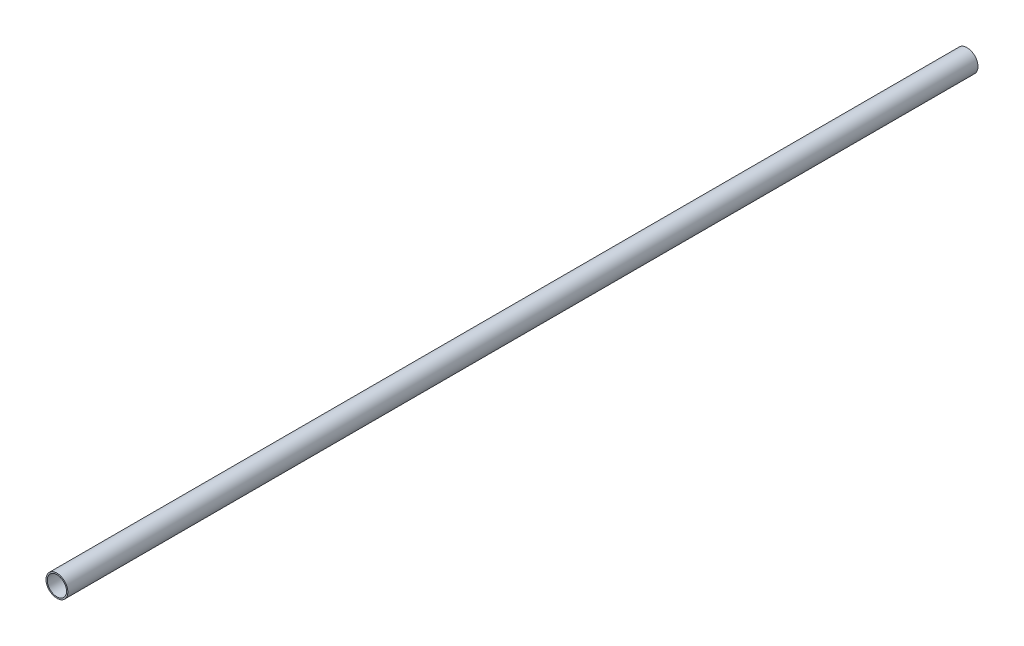
ISO-10303-21;
HEADER;
FILE_DESCRIPTION(('STEP AP214'),'2;1');
FILE_NAME('part.step','',(''),(''),'','','');
FILE_SCHEMA(('AUTOMOTIVE_DESIGN { 1 0 10303 214 1 1 1 1 }'));
ENDSEC;
DATA;
#1=APPLICATION_CONTEXT('core data for automotive mechanical design processes');
#2=APPLICATION_PROTOCOL_DEFINITION('international standard','automotive_design',2000,#1);
#3=PRODUCT_CONTEXT('',#1,'mechanical');
#4=PRODUCT('Part','Part','',(#3));
#5=PRODUCT_RELATED_PRODUCT_CATEGORY('part','',(#4));
#6=PRODUCT_DEFINITION_FORMATION('','',#4);
#7=PRODUCT_DEFINITION_CONTEXT('part definition',#1,'design');
#8=PRODUCT_DEFINITION('design','',#6,#7);
#9=PRODUCT_DEFINITION_SHAPE('','',#8);
#10=(LENGTH_UNIT() NAMED_UNIT(*) SI_UNIT(.MILLI.,.METRE.));
#11=(NAMED_UNIT(*) PLANE_ANGLE_UNIT() SI_UNIT($,.RADIAN.));
#12=(NAMED_UNIT(*) SI_UNIT($,.STERADIAN.) SOLID_ANGLE_UNIT());
#13=UNCERTAINTY_MEASURE_WITH_UNIT(LENGTH_MEASURE(1.E-05),#10,'distance_accuracy_value','');
#14=(GEOMETRIC_REPRESENTATION_CONTEXT(3) GLOBAL_UNCERTAINTY_ASSIGNED_CONTEXT((#13)) GLOBAL_UNIT_ASSIGNED_CONTEXT((#10,
#11,#12)) REPRESENTATION_CONTEXT('',''));
#15=CARTESIAN_POINT('',(0.,0.,0.));
#16=DIRECTION('',(0.,0.,1.));
#17=DIRECTION('',(1.,0.,0.));
#18=AXIS2_PLACEMENT_3D('',#15,#16,#17);
#19=CARTESIAN_POINT('',(-7.99360577730113E-12,654.,-3240.));
#20=DIRECTION('',(0.,0.,1.));
#21=DIRECTION('',(1.,0.,0.));
#22=AXIS2_PLACEMENT_3D('',#19,#20,#21);
#23=CYLINDRICAL_SURFACE('',#22,12.5);
#24=CARTESIAN_POINT('',(-1.24344978758018E-11,654.,-1060.));
#25=DIRECTION('',(0.,0.,-1.));
#26=DIRECTION('',(0.,1.,0.));
#27=AXIS2_PLACEMENT_3D('',#24,#25,#26);
#28=CIRCLE('',#27,12.5);
#29=CARTESIAN_POINT('',(12.499999999992,654.,-1060.));
#30=VERTEX_POINT('',#29);
#31=EDGE_CURVE('E59',#30,#30,#28,.T.);
#32=CARTESIAN_POINT('',(-2.22044604925031E-11,654.,-20.000000000002));
#33=DIRECTION('',(0.,0.,1.));
#34=DIRECTION('',(1.,0.,0.));
#35=AXIS2_PLACEMENT_3D('',#32,#33,#34);
#36=CIRCLE('',#35,12.5);
#37=CARTESIAN_POINT('',(12.499999999992,654.,-20.0000000000022));
#38=VERTEX_POINT('',#37);
#39=EDGE_CURVE('E45',#38,#38,#36,.T.);
#40=CARTESIAN_POINT('',(12.499999999992,654.,-1060.));
#41=CARTESIAN_POINT('',(12.499999999992,654.,-1049.16666666667));
#42=CARTESIAN_POINT('',(12.499999999992,654.,-1038.33333333333));
#43=CARTESIAN_POINT('',(12.499999999992,654.,-1016.66666666667));
#44=CARTESIAN_POINT('',(12.499999999992,654.,-1005.83333333333));
#45=CARTESIAN_POINT('',(12.499999999992,654.,-984.166666666665));
#46=CARTESIAN_POINT('',(12.499999999992,654.,-973.333333333332));
#47=CARTESIAN_POINT('',(12.499999999992,654.,-951.666666666666));
#48=CARTESIAN_POINT('',(12.499999999992,654.,-940.833333333333));
#49=CARTESIAN_POINT('',(12.499999999992,654.,-919.166666666666));
#50=CARTESIAN_POINT('',(12.499999999992,654.,-908.333333333332));
#51=CARTESIAN_POINT('',(12.499999999992,654.,-886.666666666666));
#52=CARTESIAN_POINT('',(12.499999999992,654.,-875.833333333333));
#53=CARTESIAN_POINT('',(12.499999999992,654.,-854.166666666666));
#54=CARTESIAN_POINT('',(12.499999999992,654.,-843.333333333333));
#55=CARTESIAN_POINT('',(12.499999999992,654.,-821.666666666666));
#56=CARTESIAN_POINT('',(12.499999999992,654.,-810.833333333333));
#57=CARTESIAN_POINT('',(12.499999999992,654.,-789.166666666667));
#58=CARTESIAN_POINT('',(12.499999999992,654.,-778.333333333333));
#59=CARTESIAN_POINT('',(12.499999999992,654.,-756.666666666666));
#60=CARTESIAN_POINT('',(12.499999999992,654.,-745.833333333333));
#61=CARTESIAN_POINT('',(12.499999999992,654.,-724.166666666667));
#62=CARTESIAN_POINT('',(12.499999999992,654.,-713.333333333333));
#63=CARTESIAN_POINT('',(12.499999999992,654.,-691.666666666666));
#64=CARTESIAN_POINT('',(12.499999999992,654.,-680.833333333333));
#65=CARTESIAN_POINT('',(12.499999999992,654.,-659.166666666667));
#66=CARTESIAN_POINT('',(12.499999999992,654.,-648.333333333333));
#67=CARTESIAN_POINT('',(12.499999999992,654.,-626.666666666667));
#68=CARTESIAN_POINT('',(12.499999999992,654.,-615.833333333334));
#69=CARTESIAN_POINT('',(12.499999999992,654.,-594.166666666667));
#70=CARTESIAN_POINT('',(12.499999999992,654.,-583.333333333334));
#71=CARTESIAN_POINT('',(12.499999999992,654.,-561.666666666667));
#72=CARTESIAN_POINT('',(12.499999999992,654.,-550.833333333334));
#73=CARTESIAN_POINT('',(12.499999999992,654.,-529.166666666667));
#74=CARTESIAN_POINT('',(12.499999999992,654.,-518.333333333334));
#75=CARTESIAN_POINT('',(12.499999999992,654.,-496.666666666667));
#76=CARTESIAN_POINT('',(12.499999999992,654.,-485.833333333334));
#77=CARTESIAN_POINT('',(12.499999999992,654.,-464.166666666667));
#78=CARTESIAN_POINT('',(12.499999999992,654.,-453.333333333334));
#79=CARTESIAN_POINT('',(12.499999999992,654.,-431.666666666668));
#80=CARTESIAN_POINT('',(12.499999999992,654.,-420.833333333334));
#81=CARTESIAN_POINT('',(12.499999999992,654.,-399.166666666668));
#82=CARTESIAN_POINT('',(12.499999999992,654.,-388.333333333335));
#83=CARTESIAN_POINT('',(12.499999999992,654.,-366.666666666668));
#84=CARTESIAN_POINT('',(12.499999999992,654.,-355.833333333335));
#85=CARTESIAN_POINT('',(12.499999999992,654.,-334.166666666668));
#86=CARTESIAN_POINT('',(12.499999999992,654.,-323.333333333335));
#87=CARTESIAN_POINT('',(12.499999999992,654.,-301.666666666668));
#88=CARTESIAN_POINT('',(12.499999999992,654.,-290.833333333335));
#89=CARTESIAN_POINT('',(12.499999999992,654.,-269.166666666668));
#90=CARTESIAN_POINT('',(12.499999999992,654.,-258.333333333335));
#91=CARTESIAN_POINT('',(12.499999999992,654.,-236.666666666668));
#92=CARTESIAN_POINT('',(12.499999999992,654.,-225.833333333335));
#93=CARTESIAN_POINT('',(12.499999999992,654.,-204.166666666668));
#94=CARTESIAN_POINT('',(12.499999999992,654.,-193.333333333335));
#95=CARTESIAN_POINT('',(12.499999999992,654.,-171.666666666669));
#96=CARTESIAN_POINT('',(12.499999999992,654.,-160.833333333335));
#97=CARTESIAN_POINT('',(12.499999999992,654.,-139.166666666668));
#98=CARTESIAN_POINT('',(12.499999999992,654.,-128.333333333335));
#99=CARTESIAN_POINT('',(12.499999999992,654.,-106.666666666669));
#100=CARTESIAN_POINT('',(12.499999999992,654.,-95.8333333333351));
#101=CARTESIAN_POINT('',(12.499999999992,654.,-74.1666666666685));
#102=CARTESIAN_POINT('',(12.499999999992,654.,-63.3333333333352));
#103=CARTESIAN_POINT('',(12.499999999992,654.,-41.6666666666687));
#104=CARTESIAN_POINT('',(12.499999999992,654.,-30.8333333333355));
#105=CARTESIAN_POINT('',(12.499999999992,654.,-20.0000000000022));
#106=B_SPLINE_CURVE_WITH_KNOTS('',3,(#40,#41,#42,#43,#44,#45,#46,#47,#48,#49,#50,#51,#52,#53,
#54,#55,#56,#57,#58,#59,#60,#61,#62,#63,#64,#65,#66,#67,#68,#69,#70,#71,#72,#73,#74,#75,#76,#77,
#78,#79,#80,#81,#82,#83,#84,#85,#86,#87,#88,#89,#90,#91,#92,#93,#94,#95,#96,#97,#98,#99,#100,
#101,#102,#103,#104,#105),.UNSPECIFIED.,.F.,.F.,(4,2,2,2,2,2,2,2,2,2,2,2,2,2,2,2,2,2,2,2,2,2,2,
2,2,2,2,2,2,2,2,2,4),(0.,32.4999999999998,64.9999999999999,97.4999999999997,129.999999999999,
162.5,194.999999999999,227.499999999999,259.999999999999,292.499999999999,324.999999999999,
357.499999999999,389.999999999999,422.499999999999,454.999999999998,487.499999999998,
519.999999999998,552.499999999998,584.999999999998,617.499999999998,649.999999999998,
682.499999999997,714.999999999998,747.499999999997,779.999999999998,812.499999999997,
844.999999999997,877.499999999997,909.999999999997,942.499999999997,974.999999999997,1007.5,
1040.),.UNSPECIFIED.);
#107=EDGE_CURVE('BSEAM41',#30,#38,#106,.T.);
#108=ORIENTED_EDGE('',*,*,#31,.F.);
#109=ORIENTED_EDGE('',*,*,#39,.F.);
#110=ORIENTED_EDGE('',*,*,#107,.T.);
#111=ORIENTED_EDGE('',*,*,#107,.F.);
#112=EDGE_LOOP('',(#108,#110,#109,#111));
#113=FACE_BOUND('',#112,.T.);
#114=ADVANCED_FACE('F41',(#113),#23,.T.);
#115=CARTESIAN_POINT('',(-15.5000000000096,-2.88657986402541E-12,-1059.99999999999));
#116=DIRECTION('',(0.,0.,-1.));
#117=DIRECTION('',(0.,1.,0.));
#118=AXIS2_PLACEMENT_3D('',#115,#116,#117);
#119=PLANE('',#118);
#120=CARTESIAN_POINT('',(-1.24344978758018E-11,654.,-1060.));
#121=DIRECTION('',(0.,0.,-1.));
#122=DIRECTION('',(0.,1.,0.));
#123=AXIS2_PLACEMENT_3D('',#120,#121,#122);
#124=CIRCLE('',#123,11.);
#125=CARTESIAN_POINT('',(10.999999999992,654.,-1060.));
#126=VERTEX_POINT('',#125);
#127=EDGE_CURVE('E57',#126,#126,#124,.T.);
#128=ORIENTED_EDGE('',*,*,#127,.F.);
#129=EDGE_LOOP('',(#128));
#130=FACE_BOUND('',#129,.T.);
#131=ORIENTED_EDGE('',*,*,#31,.T.);
#132=EDGE_LOOP('',(#131));
#133=FACE_BOUND('',#132,.T.);
#134=ADVANCED_FACE('F73',(#130,#133),#119,.T.);
#135=CARTESIAN_POINT('',(-15.5000000000145,4.21884749357559E-12,-20.));
#136=DIRECTION('',(0.,0.,1.));
#137=DIRECTION('',(1.,0.,0.));
#138=AXIS2_PLACEMENT_3D('',#135,#136,#137);
#139=PLANE('',#138);
#140=CARTESIAN_POINT('',(-2.22044604925031E-11,654.,-20.000000000002));
#141=DIRECTION('',(0.,0.,1.));
#142=DIRECTION('',(1.,0.,0.));
#143=AXIS2_PLACEMENT_3D('',#140,#141,#142);
#144=CIRCLE('',#143,11.);
#145=CARTESIAN_POINT('',(10.999999999992,654.,-20.0000000000022));
#146=VERTEX_POINT('',#145);
#147=EDGE_CURVE('E10',#146,#146,#144,.T.);
#148=ORIENTED_EDGE('',*,*,#147,.F.);
#149=EDGE_LOOP('',(#148));
#150=FACE_BOUND('',#149,.T.);
#151=ORIENTED_EDGE('',*,*,#39,.T.);
#152=EDGE_LOOP('',(#151));
#153=FACE_BOUND('',#152,.T.);
#154=ADVANCED_FACE('F75',(#150,#153),#139,.T.);
#155=CARTESIAN_POINT('',(-7.99360577730113E-12,654.,-3240.));
#156=DIRECTION('',(0.,0.,1.));
#157=DIRECTION('',(1.,0.,0.));
#158=AXIS2_PLACEMENT_3D('',#155,#156,#157);
#159=CYLINDRICAL_SURFACE('',#158,11.);
#160=CARTESIAN_POINT('',(10.999999999992,654.,-1060.));
#161=CARTESIAN_POINT('',(10.999999999992,654.,-1049.16666666667));
#162=CARTESIAN_POINT('',(10.999999999992,654.,-1038.33333333333));
#163=CARTESIAN_POINT('',(10.999999999992,654.,-1016.66666666667));
#164=CARTESIAN_POINT('',(10.999999999992,654.,-1005.83333333333));
#165=CARTESIAN_POINT('',(10.999999999992,654.,-984.166666666665));
#166=CARTESIAN_POINT('',(10.999999999992,654.,-973.333333333332));
#167=CARTESIAN_POINT('',(10.999999999992,654.,-951.666666666666));
#168=CARTESIAN_POINT('',(10.999999999992,654.,-940.833333333333));
#169=CARTESIAN_POINT('',(10.999999999992,654.,-919.166666666666));
#170=CARTESIAN_POINT('',(10.999999999992,654.,-908.333333333332));
#171=CARTESIAN_POINT('',(10.999999999992,654.,-886.666666666666));
#172=CARTESIAN_POINT('',(10.999999999992,654.,-875.833333333333));
#173=CARTESIAN_POINT('',(10.999999999992,654.,-854.166666666666));
#174=CARTESIAN_POINT('',(10.999999999992,654.,-843.333333333333));
#175=CARTESIAN_POINT('',(10.999999999992,654.,-821.666666666666));
#176=CARTESIAN_POINT('',(10.999999999992,654.,-810.833333333333));
#177=CARTESIAN_POINT('',(10.999999999992,654.,-789.166666666667));
#178=CARTESIAN_POINT('',(10.999999999992,654.,-778.333333333333));
#179=CARTESIAN_POINT('',(10.999999999992,654.,-756.666666666666));
#180=CARTESIAN_POINT('',(10.999999999992,654.,-745.833333333333));
#181=CARTESIAN_POINT('',(10.999999999992,654.,-724.166666666667));
#182=CARTESIAN_POINT('',(10.999999999992,654.,-713.333333333333));
#183=CARTESIAN_POINT('',(10.999999999992,654.,-691.666666666666));
#184=CARTESIAN_POINT('',(10.999999999992,654.,-680.833333333333));
#185=CARTESIAN_POINT('',(10.999999999992,654.,-659.166666666667));
#186=CARTESIAN_POINT('',(10.999999999992,654.,-648.333333333333));
#187=CARTESIAN_POINT('',(10.999999999992,654.,-626.666666666667));
#188=CARTESIAN_POINT('',(10.999999999992,654.,-615.833333333334));
#189=CARTESIAN_POINT('',(10.999999999992,654.,-594.166666666667));
#190=CARTESIAN_POINT('',(10.999999999992,654.,-583.333333333334));
#191=CARTESIAN_POINT('',(10.999999999992,654.,-561.666666666667));
#192=CARTESIAN_POINT('',(10.999999999992,654.,-550.833333333334));
#193=CARTESIAN_POINT('',(10.999999999992,654.,-529.166666666667));
#194=CARTESIAN_POINT('',(10.999999999992,654.,-518.333333333334));
#195=CARTESIAN_POINT('',(10.999999999992,654.,-496.666666666667));
#196=CARTESIAN_POINT('',(10.999999999992,654.,-485.833333333334));
#197=CARTESIAN_POINT('',(10.999999999992,654.,-464.166666666667));
#198=CARTESIAN_POINT('',(10.999999999992,654.,-453.333333333334));
#199=CARTESIAN_POINT('',(10.999999999992,654.,-431.666666666668));
#200=CARTESIAN_POINT('',(10.999999999992,654.,-420.833333333334));
#201=CARTESIAN_POINT('',(10.999999999992,654.,-399.166666666668));
#202=CARTESIAN_POINT('',(10.999999999992,654.,-388.333333333335));
#203=CARTESIAN_POINT('',(10.999999999992,654.,-366.666666666668));
#204=CARTESIAN_POINT('',(10.999999999992,654.,-355.833333333335));
#205=CARTESIAN_POINT('',(10.999999999992,654.,-334.166666666668));
#206=CARTESIAN_POINT('',(10.999999999992,654.,-323.333333333335));
#207=CARTESIAN_POINT('',(10.999999999992,654.,-301.666666666668));
#208=CARTESIAN_POINT('',(10.999999999992,654.,-290.833333333335));
#209=CARTESIAN_POINT('',(10.999999999992,654.,-269.166666666668));
#210=CARTESIAN_POINT('',(10.999999999992,654.,-258.333333333335));
#211=CARTESIAN_POINT('',(10.999999999992,654.,-236.666666666668));
#212=CARTESIAN_POINT('',(10.999999999992,654.,-225.833333333335));
#213=CARTESIAN_POINT('',(10.999999999992,654.,-204.166666666668));
#214=CARTESIAN_POINT('',(10.999999999992,654.,-193.333333333335));
#215=CARTESIAN_POINT('',(10.999999999992,654.,-171.666666666669));
#216=CARTESIAN_POINT('',(10.999999999992,654.,-160.833333333335));
#217=CARTESIAN_POINT('',(10.999999999992,654.,-139.166666666668));
#218=CARTESIAN_POINT('',(10.999999999992,654.,-128.333333333335));
#219=CARTESIAN_POINT('',(10.999999999992,654.,-106.666666666669));
#220=CARTESIAN_POINT('',(10.999999999992,654.,-95.8333333333351));
#221=CARTESIAN_POINT('',(10.999999999992,654.,-74.1666666666685));
#222=CARTESIAN_POINT('',(10.999999999992,654.,-63.3333333333352));
#223=CARTESIAN_POINT('',(10.999999999992,654.,-41.6666666666687));
#224=CARTESIAN_POINT('',(10.999999999992,654.,-30.8333333333355));
#225=CARTESIAN_POINT('',(10.999999999992,654.,-20.0000000000022));
#226=B_SPLINE_CURVE_WITH_KNOTS('',3,(#160,#161,#162,#163,#164,#165,#166,#167,#168,#169,#170,
#171,#172,#173,#174,#175,#176,#177,#178,#179,#180,#181,#182,#183,#184,#185,#186,#187,#188,#189,
#190,#191,#192,#193,#194,#195,#196,#197,#198,#199,#200,#201,#202,#203,#204,#205,#206,#207,#208,
#209,#210,#211,#212,#213,#214,#215,#216,#217,#218,#219,#220,#221,#222,#223,#224,#225),
.UNSPECIFIED.,.F.,.F.,(4,2,2,2,2,2,2,2,2,2,2,2,2,2,2,2,2,2,2,2,2,2,2,2,2,2,2,2,2,2,2,2,4),(0.,
32.4999999999998,64.9999999999999,97.4999999999997,129.999999999999,162.5,194.999999999999,
227.499999999999,259.999999999999,292.499999999999,324.999999999999,357.499999999999,
389.999999999999,422.499999999999,454.999999999998,487.499999999998,519.999999999998,
552.499999999998,584.999999999998,617.499999999998,649.999999999998,682.499999999997,
714.999999999998,747.499999999997,779.999999999998,812.499999999997,844.999999999997,
877.499999999997,909.999999999997,942.499999999997,974.999999999997,1007.5,1040.),.UNSPECIFIED.);
#227=EDGE_CURVE('BSEAM43',#126,#146,#226,.T.);
#228=ORIENTED_EDGE('',*,*,#127,.T.);
#229=ORIENTED_EDGE('',*,*,#147,.T.);
#230=ORIENTED_EDGE('',*,*,#227,.T.);
#231=ORIENTED_EDGE('',*,*,#227,.F.);
#232=EDGE_LOOP('',(#228,#230,#229,#231));
#233=FACE_BOUND('',#232,.T.);
#234=ADVANCED_FACE('F43',(#233),#159,.F.);
#235=CLOSED_SHELL('',(#114,#134,#154,#234));
#236=MANIFOLD_SOLID_BREP('B2',#235);
#237=ADVANCED_BREP_SHAPE_REPRESENTATION('',(#18,#236),#14);
#238=SHAPE_DEFINITION_REPRESENTATION(#9,#237);
ENDSEC;
END-ISO-10303-21;
